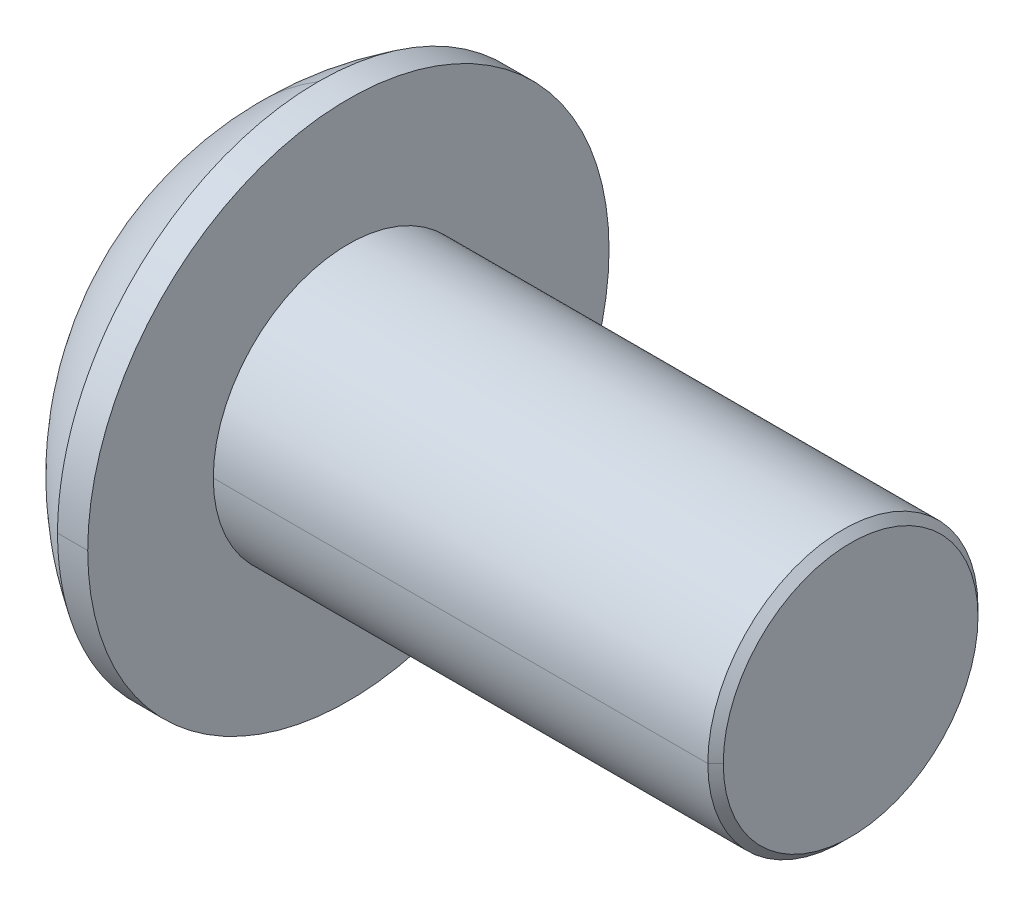
ISO-10303-21;
HEADER;
FILE_DESCRIPTION(('STEP AP214'),'2;1');
FILE_NAME('part.step','',(''),(''),'','','');
FILE_SCHEMA(('AUTOMOTIVE_DESIGN { 1 0 10303 214 1 1 1 1 }'));
ENDSEC;
DATA;
#1=APPLICATION_CONTEXT('core data for automotive mechanical design processes');
#2=APPLICATION_PROTOCOL_DEFINITION('international standard','automotive_design',2000,#1);
#3=PRODUCT_CONTEXT('',#1,'mechanical');
#4=PRODUCT('Part','Part','',(#3));
#5=PRODUCT_RELATED_PRODUCT_CATEGORY('part','',(#4));
#6=PRODUCT_DEFINITION_FORMATION('','',#4);
#7=PRODUCT_DEFINITION_CONTEXT('part definition',#1,'design');
#8=PRODUCT_DEFINITION('design','',#6,#7);
#9=PRODUCT_DEFINITION_SHAPE('','',#8);
#10=(LENGTH_UNIT() NAMED_UNIT(*) SI_UNIT(.MILLI.,.METRE.));
#11=(NAMED_UNIT(*) PLANE_ANGLE_UNIT() SI_UNIT($,.RADIAN.));
#12=(NAMED_UNIT(*) SI_UNIT($,.STERADIAN.) SOLID_ANGLE_UNIT());
#13=UNCERTAINTY_MEASURE_WITH_UNIT(LENGTH_MEASURE(1.E-05),#10,'distance_accuracy_value','');
#14=(GEOMETRIC_REPRESENTATION_CONTEXT(3) GLOBAL_UNCERTAINTY_ASSIGNED_CONTEXT((#13)) GLOBAL_UNIT_ASSIGNED_CONTEXT((#10,
#11,#12)) REPRESENTATION_CONTEXT('',''));
#15=CARTESIAN_POINT('',(0.,0.,0.));
#16=DIRECTION('',(0.,0.,1.));
#17=DIRECTION('',(1.,0.,0.));
#18=AXIS2_PLACEMENT_3D('',#15,#16,#17);
#19=CARTESIAN_POINT('',(-997.989959248641,0.,0.));
#20=DIRECTION('',(-1.,0.,0.));
#21=DIRECTION('',(0.,0.,1.));
#22=AXIS2_PLACEMENT_3D('',#19,#20,#21);
#23=CONICAL_SURFACE('',#22,1732.05080756886,1.0471975511966);
#24=DIRECTION('',(-0.5,0.,0.866025403784436));
#25=VECTOR('',#24,1.);
#26=CARTESIAN_POINT('',(2.01004075135859,0.,0.));
#27=LINE('',#26,#25);
#28=CARTESIAN_POINT('',(2.01004075135859,0.,0.));
#29=VERTEX_POINT('',#28);
#30=CARTESIAN_POINT('',(1.3208,0.,1.1938));
#31=VERTEX_POINT('',#30);
#32=EDGE_CURVE('E41',#29,#31,#27,.T.);
#33=ORIENTED_EDGE('',*,*,#32,.F.);
#34=DIRECTION('',(-0.5,0.,-0.866025403784436));
#35=VECTOR('',#34,1.);
#36=CARTESIAN_POINT('',(2.01004075135859,0.,0.));
#37=LINE('',#36,#35);
#38=CARTESIAN_POINT('',(1.3208,0.,-1.1938));
#39=VERTEX_POINT('',#38);
#40=EDGE_CURVE('E11',#29,#39,#37,.T.);
#41=ORIENTED_EDGE('',*,*,#40,.T.);
#42=CARTESIAN_POINT('',(1.3208,0.,0.));
#43=DIRECTION('',(-1.,0.,0.));
#44=DIRECTION('',(0.,0.,1.));
#45=AXIS2_PLACEMENT_3D('',#42,#43,#44);
#46=CIRCLE('',#45,1.1938);
#47=CARTESIAN_POINT('',(1.3208,-1.03386112703786,-0.5969));
#48=VERTEX_POINT('',#47);
#49=EDGE_CURVE('E27',#39,#48,#46,.T.);
#50=ORIENTED_EDGE('',*,*,#49,.T.);
#51=CARTESIAN_POINT('',(1.3208,0.,0.));
#52=DIRECTION('',(-1.,0.,0.));
#53=DIRECTION('',(0.,0.,1.));
#54=AXIS2_PLACEMENT_3D('',#51,#52,#53);
#55=CIRCLE('',#54,1.1938);
#56=CARTESIAN_POINT('',(1.3208,-1.03386112703786,0.5969));
#57=VERTEX_POINT('',#56);
#58=EDGE_CURVE('E248',#48,#57,#55,.T.);
#59=ORIENTED_EDGE('',*,*,#58,.T.);
#60=CARTESIAN_POINT('',(1.3208,0.,0.));
#61=DIRECTION('',(-1.,0.,0.));
#62=DIRECTION('',(0.,0.,1.));
#63=AXIS2_PLACEMENT_3D('',#60,#61,#62);
#64=CIRCLE('',#63,1.1938);
#65=EDGE_CURVE('E252',#57,#31,#64,.T.);
#66=ORIENTED_EDGE('',*,*,#65,.T.);
#67=EDGE_LOOP('',(#33,#41,#50,#59,#66));
#68=FACE_BOUND('',#67,.T.);
#69=ADVANCED_FACE('F16',(#68),#23,.F.);
#70=CARTESIAN_POINT('',(8.2042,0.,0.));
#71=DIRECTION('',(-1.,0.,0.));
#72=DIRECTION('',(0.,0.,1.));
#73=AXIS2_PLACEMENT_3D('',#70,#71,#72);
#74=CONICAL_SURFACE('',#73,1.61036,0.785398163397723);
#75=CARTESIAN_POINT('',(8.2042,0.,0.));
#76=DIRECTION('',(-1.,0.,0.));
#77=DIRECTION('',(0.,0.,1.));
#78=AXIS2_PLACEMENT_3D('',#75,#76,#77);
#79=CIRCLE('',#78,1.61036);
#80=CARTESIAN_POINT('',(8.2042,0.,1.61036));
#81=VERTEX_POINT('',#80);
#82=CARTESIAN_POINT('',(8.2042,0.,-1.61036));
#83=VERTEX_POINT('',#82);
#84=EDGE_CURVE('E255',#81,#83,#79,.T.);
#85=ORIENTED_EDGE('',*,*,#84,.T.);
#86=DIRECTION('',(-0.707106781186353,0.,-0.707106781186742));
#87=VECTOR('',#86,1.);
#88=CARTESIAN_POINT('',(8.2042,0.,-1.61036));
#89=LINE('',#88,#87);
#90=CARTESIAN_POINT('',(8.10641,0.,-1.70815));
#91=VERTEX_POINT('',#90);
#92=EDGE_CURVE('E334',#83,#91,#89,.T.);
#93=ORIENTED_EDGE('',*,*,#92,.T.);
#94=CARTESIAN_POINT('',(8.10641,0.,0.));
#95=DIRECTION('',(-1.,0.,0.));
#96=DIRECTION('',(0.,0.,1.));
#97=AXIS2_PLACEMENT_3D('',#94,#95,#96);
#98=CIRCLE('',#97,1.70815);
#99=CARTESIAN_POINT('',(8.10641,0.,1.70815));
#100=VERTEX_POINT('',#99);
#101=EDGE_CURVE('E328',#100,#91,#98,.T.);
#102=ORIENTED_EDGE('',*,*,#101,.F.);
#103=DIRECTION('',(-0.707106781186353,0.,0.707106781186742));
#104=VECTOR('',#103,1.);
#105=CARTESIAN_POINT('',(8.2042,0.,1.61036));
#106=LINE('',#105,#104);
#107=EDGE_CURVE('E227',#81,#100,#106,.T.);
#108=ORIENTED_EDGE('',*,*,#107,.F.);
#109=EDGE_LOOP('',(#85,#93,#102,#108));
#110=FACE_BOUND('',#109,.T.);
#111=ADVANCED_FACE('F612',(#110),#74,.T.);
#112=CARTESIAN_POINT('',(0.,0.,0.));
#113=DIRECTION('',(-1.,0.,0.));
#114=DIRECTION('',(0.,0.,1.));
#115=AXIS2_PLACEMENT_3D('',#112,#113,#114);
#116=CYLINDRICAL_SURFACE('',#115,1.70815);
#117=ORIENTED_EDGE('',*,*,#101,.T.);
#118=DIRECTION('',(-1.,0.,0.));
#119=VECTOR('',#118,1.);
#120=CARTESIAN_POINT('',(0.,0.,-1.70815));
#121=LINE('',#120,#119);
#122=CARTESIAN_POINT('',(1.8542,0.,-1.70815));
#123=VERTEX_POINT('',#122);
#124=EDGE_CURVE('E274',#91,#123,#121,.T.);
#125=ORIENTED_EDGE('',*,*,#124,.T.);
#126=CARTESIAN_POINT('',(1.8542,0.,0.));
#127=DIRECTION('',(-1.,0.,0.));
#128=DIRECTION('',(0.,0.,1.));
#129=AXIS2_PLACEMENT_3D('',#126,#127,#128);
#130=CIRCLE('',#129,1.70815);
#131=CARTESIAN_POINT('',(1.8542,0.,1.70815));
#132=VERTEX_POINT('',#131);
#133=EDGE_CURVE('E97',#132,#123,#130,.T.);
#134=ORIENTED_EDGE('',*,*,#133,.F.);
#135=DIRECTION('',(-1.,0.,0.));
#136=VECTOR('',#135,1.);
#137=CARTESIAN_POINT('',(0.,0.,1.70815));
#138=LINE('',#137,#136);
#139=EDGE_CURVE('E113',#100,#132,#138,.T.);
#140=ORIENTED_EDGE('',*,*,#139,.F.);
#141=EDGE_LOOP('',(#117,#125,#134,#140));
#142=FACE_BOUND('',#141,.T.);
#143=ADVANCED_FACE('F616',(#142),#116,.T.);
#144=CARTESIAN_POINT('',(0.,0.,0.));
#145=DIRECTION('',(-1.,0.,0.));
#146=DIRECTION('',(0.,0.,1.));
#147=AXIS2_PLACEMENT_3D('',#144,#145,#146);
#148=CYLINDRICAL_SURFACE('',#147,3.29565);
#149=CARTESIAN_POINT('',(1.8542,0.,0.));
#150=DIRECTION('',(-1.,0.,0.));
#151=DIRECTION('',(0.,0.,1.));
#152=AXIS2_PLACEMENT_3D('',#149,#150,#151);
#153=CIRCLE('',#152,3.29565);
#154=CARTESIAN_POINT('',(1.8542,0.,3.29565));
#155=VERTEX_POINT('',#154);
#156=CARTESIAN_POINT('',(1.8542,0.,-3.29565));
#157=VERTEX_POINT('',#156);
#158=EDGE_CURVE('E199',#155,#157,#153,.T.);
#159=ORIENTED_EDGE('',*,*,#158,.T.);
#160=DIRECTION('',(-1.,0.,0.));
#161=VECTOR('',#160,1.);
#162=CARTESIAN_POINT('',(0.,0.,-3.29565));
#163=LINE('',#162,#161);
#164=CARTESIAN_POINT('',(1.4732,0.,-3.29565));
#165=VERTEX_POINT('',#164);
#166=EDGE_CURVE('E194',#157,#165,#163,.T.);
#167=ORIENTED_EDGE('',*,*,#166,.T.);
#168=CARTESIAN_POINT('',(1.4732,0.,0.));
#169=DIRECTION('',(-1.,0.,0.));
#170=DIRECTION('',(0.,0.,1.));
#171=AXIS2_PLACEMENT_3D('',#168,#169,#170);
#172=CIRCLE('',#171,3.29565);
#173=CARTESIAN_POINT('',(1.4732,3.29565,0.));
#174=VERTEX_POINT('',#173);
#175=EDGE_CURVE('E182',#174,#165,#172,.T.);
#176=ORIENTED_EDGE('',*,*,#175,.F.);
#177=CARTESIAN_POINT('',(1.4732,0.,0.));
#178=DIRECTION('',(-1.,0.,0.));
#179=DIRECTION('',(0.,0.,1.));
#180=AXIS2_PLACEMENT_3D('',#177,#178,#179);
#181=CIRCLE('',#180,3.29565);
#182=CARTESIAN_POINT('',(1.4732,0.,3.29565));
#183=VERTEX_POINT('',#182);
#184=EDGE_CURVE('E373',#183,#174,#181,.T.);
#185=ORIENTED_EDGE('',*,*,#184,.F.);
#186=DIRECTION('',(-1.,0.,0.));
#187=VECTOR('',#186,1.);
#188=CARTESIAN_POINT('',(0.,0.,3.29565));
#189=LINE('',#188,#187);
#190=EDGE_CURVE('E259',#155,#183,#189,.T.);
#191=ORIENTED_EDGE('',*,*,#190,.F.);
#192=EDGE_LOOP('',(#159,#167,#176,#185,#191));
#193=FACE_BOUND('',#192,.T.);
#194=ADVANCED_FACE('F197',(#193),#148,.T.);
#195=CARTESIAN_POINT('',(3.50132362607759,0.,0.));
#196=DIRECTION('',(0.,0.,-1.));
#197=DIRECTION('',(0.,1.,0.));
#198=AXIS2_PLACEMENT_3D('',#195,#196,#197);
#199=SPHERICAL_SURFACE('',#198,3.86970210289554);
#200=ORIENTED_EDGE('',*,*,#175,.T.);
#201=CARTESIAN_POINT('',(1.4732,0.,0.));
#202=DIRECTION('',(-1.,0.,0.));
#203=DIRECTION('',(0.,0.,1.));
#204=AXIS2_PLACEMENT_3D('',#201,#202,#203);
#205=CIRCLE('',#204,3.29565);
#206=CARTESIAN_POINT('',(1.4732,-3.29565,0.));
#207=VERTEX_POINT('',#206);
#208=EDGE_CURVE('E187',#165,#207,#205,.T.);
#209=ORIENTED_EDGE('',*,*,#208,.T.);
#210=CARTESIAN_POINT('',(3.50132362607759,0.,0.));
#211=DIRECTION('',(0.,0.,-1.));
#212=DIRECTION('',(0.,1.,0.));
#213=AXIS2_PLACEMENT_3D('',#210,#211,#212);
#214=CIRCLE('',#213,3.86970210289554);
#215=CARTESIAN_POINT('',(0.,-1.647825,0.));
#216=VERTEX_POINT('',#215);
#217=EDGE_CURVE('E209',#207,#216,#214,.T.);
#218=ORIENTED_EDGE('',*,*,#217,.T.);
#219=CARTESIAN_POINT('',(0.,0.,0.));
#220=DIRECTION('',(-1.,0.,0.));
#221=DIRECTION('',(0.,0.,1.));
#222=AXIS2_PLACEMENT_3D('',#219,#220,#221);
#223=CIRCLE('',#222,1.647825);
#224=CARTESIAN_POINT('',(0.,1.647825,0.));
#225=VERTEX_POINT('',#224);
#226=EDGE_CURVE('E215',#225,#216,#223,.T.);
#227=ORIENTED_EDGE('',*,*,#226,.F.);
#228=CARTESIAN_POINT('',(3.50132362607759,0.,0.));
#229=DIRECTION('',(0.,0.,1.));
#230=DIRECTION('',(1.,0.,0.));
#231=AXIS2_PLACEMENT_3D('',#228,#229,#230);
#232=CIRCLE('',#231,3.86970210289554);
#233=EDGE_CURVE('E190',#174,#225,#232,.T.);
#234=ORIENTED_EDGE('',*,*,#233,.F.);
#235=EDGE_LOOP('',(#200,#209,#218,#227,#234));
#236=FACE_BOUND('',#235,.T.);
#237=ADVANCED_FACE('F184',(#236),#199,.T.);
#238=CARTESIAN_POINT('',(0.,0.,0.));
#239=DIRECTION('',(-1.,0.,0.));
#240=DIRECTION('',(0.,0.,1.));
#241=AXIS2_PLACEMENT_3D('',#238,#239,#240);
#242=PLANE('',#241);
#243=ORIENTED_EDGE('',*,*,#226,.T.);
#244=CARTESIAN_POINT('',(0.,0.,0.));
#245=DIRECTION('',(-1.,0.,0.));
#246=DIRECTION('',(0.,0.,1.));
#247=AXIS2_PLACEMENT_3D('',#244,#245,#246);
#248=CIRCLE('',#247,1.647825);
#249=EDGE_CURVE('E222',#216,#225,#248,.T.);
#250=ORIENTED_EDGE('',*,*,#249,.T.);
#251=EDGE_LOOP('',(#243,#250));
#252=FACE_BOUND('',#251,.T.);
#253=DIRECTION('',(0.,-1.,0.));
#254=VECTOR('',#253,1.);
#255=CARTESIAN_POINT('',(0.,-0.689240751358575,1.1938));
#256=LINE('',#255,#254);
#257=CARTESIAN_POINT('',(0.,0.689240751358575,1.1938));
#258=VERTEX_POINT('',#257);
#259=CARTESIAN_POINT('',(0.,-0.689240751358575,1.1938));
#260=VERTEX_POINT('',#259);
#261=EDGE_CURVE('E219',#258,#260,#256,.T.);
#262=ORIENTED_EDGE('',*,*,#261,.T.);
#263=DIRECTION('',(0.,-0.5,-0.866025403784439));
#264=VECTOR('',#263,1.);
#265=CARTESIAN_POINT('',(0.,-1.37848150271715,0.));
#266=LINE('',#265,#264);
#267=CARTESIAN_POINT('',(0.,-1.37848150271715,0.));
#268=VERTEX_POINT('',#267);
#269=EDGE_CURVE('E223',#260,#268,#266,.T.);
#270=ORIENTED_EDGE('',*,*,#269,.T.);
#271=DIRECTION('',(0.,0.5,-0.866025403784439));
#272=VECTOR('',#271,1.);
#273=CARTESIAN_POINT('',(0.,-0.689240751358575,-1.1938));
#274=LINE('',#273,#272);
#275=CARTESIAN_POINT('',(0.,-0.689240751358575,-1.1938));
#276=VERTEX_POINT('',#275);
#277=EDGE_CURVE('E233',#268,#276,#274,.T.);
#278=ORIENTED_EDGE('',*,*,#277,.T.);
#279=DIRECTION('',(0.,1.,0.));
#280=VECTOR('',#279,1.);
#281=CARTESIAN_POINT('',(0.,0.689240751358575,-1.1938));
#282=LINE('',#281,#280);
#283=CARTESIAN_POINT('',(0.,0.689240751358575,-1.1938));
#284=VERTEX_POINT('',#283);
#285=EDGE_CURVE('E229',#276,#284,#282,.T.);
#286=ORIENTED_EDGE('',*,*,#285,.T.);
#287=DIRECTION('',(0.,0.5,0.866025403784439));
#288=VECTOR('',#287,1.);
#289=CARTESIAN_POINT('',(0.,1.37848150271715,0.));
#290=LINE('',#289,#288);
#291=CARTESIAN_POINT('',(0.,1.37848150271715,0.));
#292=VERTEX_POINT('',#291);
#293=EDGE_CURVE('E234',#284,#292,#290,.T.);
#294=ORIENTED_EDGE('',*,*,#293,.T.);
#295=DIRECTION('',(0.,-0.5,0.866025403784439));
#296=VECTOR('',#295,1.);
#297=CARTESIAN_POINT('',(0.,0.689240751358575,1.1938));
#298=LINE('',#297,#296);
#299=EDGE_CURVE('E264',#292,#258,#298,.T.);
#300=ORIENTED_EDGE('',*,*,#299,.T.);
#301=EDGE_LOOP('',(#262,#270,#278,#286,#294,#300));
#302=FACE_BOUND('',#301,.T.);
#303=ADVANCED_FACE('F423',(#252,#302),#242,.T.);
#304=CARTESIAN_POINT('',(3.50132362607759,0.,0.));
#305=DIRECTION('',(0.,0.,-1.));
#306=DIRECTION('',(0.,1.,0.));
#307=AXIS2_PLACEMENT_3D('',#304,#305,#306);
#308=SPHERICAL_SURFACE('',#307,3.86970210289554);
#309=ORIENTED_EDGE('',*,*,#217,.F.);
#310=CARTESIAN_POINT('',(1.4732,0.,0.));
#311=DIRECTION('',(-1.,0.,0.));
#312=DIRECTION('',(0.,0.,1.));
#313=AXIS2_PLACEMENT_3D('',#310,#311,#312);
#314=CIRCLE('',#313,3.29565);
#315=EDGE_CURVE('E207',#207,#183,#314,.T.);
#316=ORIENTED_EDGE('',*,*,#315,.T.);
#317=ORIENTED_EDGE('',*,*,#184,.T.);
#318=ORIENTED_EDGE('',*,*,#233,.T.);
#319=ORIENTED_EDGE('',*,*,#249,.F.);
#320=EDGE_LOOP('',(#309,#316,#317,#318,#319));
#321=FACE_BOUND('',#320,.T.);
#322=ADVANCED_FACE('F521',(#321),#308,.T.);
#323=CARTESIAN_POINT('',(0.,0.,0.));
#324=DIRECTION('',(-1.,0.,0.));
#325=DIRECTION('',(0.,0.,1.));
#326=AXIS2_PLACEMENT_3D('',#323,#324,#325);
#327=CYLINDRICAL_SURFACE('',#326,3.29565);
#328=ORIENTED_EDGE('',*,*,#166,.F.);
#329=CARTESIAN_POINT('',(1.8542,0.,0.));
#330=DIRECTION('',(-1.,0.,0.));
#331=DIRECTION('',(0.,0.,1.));
#332=AXIS2_PLACEMENT_3D('',#329,#330,#331);
#333=CIRCLE('',#332,3.29565);
#334=EDGE_CURVE('E256',#157,#155,#333,.T.);
#335=ORIENTED_EDGE('',*,*,#334,.T.);
#336=ORIENTED_EDGE('',*,*,#190,.T.);
#337=ORIENTED_EDGE('',*,*,#315,.F.);
#338=ORIENTED_EDGE('',*,*,#208,.F.);
#339=EDGE_LOOP('',(#328,#335,#336,#337,#338));
#340=FACE_BOUND('',#339,.T.);
#341=ADVANCED_FACE('F205',(#340),#327,.T.);
#342=CARTESIAN_POINT('',(1.8542,1.70815,0.));
#343=DIRECTION('',(-1.,0.,0.));
#344=DIRECTION('',(0.,0.,1.));
#345=AXIS2_PLACEMENT_3D('',#342,#343,#344);
#346=PLANE('',#345);
#347=ORIENTED_EDGE('',*,*,#158,.F.);
#348=ORIENTED_EDGE('',*,*,#334,.F.);
#349=EDGE_LOOP('',(#347,#348));
#350=FACE_BOUND('',#349,.T.);
#351=ORIENTED_EDGE('',*,*,#133,.T.);
#352=CARTESIAN_POINT('',(1.8542,0.,0.));
#353=DIRECTION('',(-1.,0.,0.));
#354=DIRECTION('',(0.,0.,1.));
#355=AXIS2_PLACEMENT_3D('',#352,#353,#354);
#356=CIRCLE('',#355,1.70815);
#357=EDGE_CURVE('E345',#123,#132,#356,.T.);
#358=ORIENTED_EDGE('',*,*,#357,.T.);
#359=EDGE_LOOP('',(#351,#358));
#360=FACE_BOUND('',#359,.T.);
#361=ADVANCED_FACE('F551',(#350,#360),#346,.F.);
#362=CARTESIAN_POINT('',(0.,0.,0.));
#363=DIRECTION('',(-1.,0.,0.));
#364=DIRECTION('',(0.,0.,1.));
#365=AXIS2_PLACEMENT_3D('',#362,#363,#364);
#366=CYLINDRICAL_SURFACE('',#365,1.70815);
#367=ORIENTED_EDGE('',*,*,#124,.F.);
#368=CARTESIAN_POINT('',(8.10641,0.,0.));
#369=DIRECTION('',(-1.,0.,0.));
#370=DIRECTION('',(0.,0.,1.));
#371=AXIS2_PLACEMENT_3D('',#368,#369,#370);
#372=CIRCLE('',#371,1.70815);
#373=EDGE_CURVE('E348',#91,#100,#372,.T.);
#374=ORIENTED_EDGE('',*,*,#373,.T.);
#375=ORIENTED_EDGE('',*,*,#139,.T.);
#376=ORIENTED_EDGE('',*,*,#357,.F.);
#377=EDGE_LOOP('',(#367,#374,#375,#376));
#378=FACE_BOUND('',#377,.T.);
#379=ADVANCED_FACE('F542',(#378),#366,.T.);
#380=CARTESIAN_POINT('',(8.2042,0.,0.));
#381=DIRECTION('',(-1.,0.,0.));
#382=DIRECTION('',(0.,0.,1.));
#383=AXIS2_PLACEMENT_3D('',#380,#381,#382);
#384=CONICAL_SURFACE('',#383,1.61036,0.785398163397723);
#385=ORIENTED_EDGE('',*,*,#92,.F.);
#386=CARTESIAN_POINT('',(8.2042,0.,0.));
#387=DIRECTION('',(-1.,0.,0.));
#388=DIRECTION('',(0.,0.,1.));
#389=AXIS2_PLACEMENT_3D('',#386,#387,#388);
#390=CIRCLE('',#389,1.61036);
#391=EDGE_CURVE('E238',#83,#81,#390,.T.);
#392=ORIENTED_EDGE('',*,*,#391,.T.);
#393=ORIENTED_EDGE('',*,*,#107,.T.);
#394=ORIENTED_EDGE('',*,*,#373,.F.);
#395=EDGE_LOOP('',(#385,#392,#393,#394));
#396=FACE_BOUND('',#395,.T.);
#397=ADVANCED_FACE('F537',(#396),#384,.T.);
#398=CARTESIAN_POINT('',(8.2042,0.,0.));
#399=DIRECTION('',(-1.,0.,0.));
#400=DIRECTION('',(0.,0.,1.));
#401=AXIS2_PLACEMENT_3D('',#398,#399,#400);
#402=PLANE('',#401);
#403=ORIENTED_EDGE('',*,*,#84,.F.);
#404=ORIENTED_EDGE('',*,*,#391,.F.);
#405=EDGE_LOOP('',(#403,#404));
#406=FACE_BOUND('',#405,.T.);
#407=ADVANCED_FACE('F541',(#406),#402,.F.);
#408=CARTESIAN_POINT('',(1.3208,-1.37848150271715,0.));
#409=DIRECTION('',(0.,0.866025403784439,-0.5));
#410=DIRECTION('',(-1.,0.,0.));
#411=AXIS2_PLACEMENT_3D('',#408,#409,#410);
#412=PLANE('',#411);
#413=DIRECTION('',(0.,-0.5,-0.866025403784439));
#414=VECTOR('',#413,1.);
#415=CARTESIAN_POINT('',(1.3208,-1.37848150271715,0.));
#416=LINE('',#415,#414);
#417=CARTESIAN_POINT('',(1.3208,-0.689240751358575,1.1938));
#418=VERTEX_POINT('',#417);
#419=EDGE_CURVE('E224',#418,#57,#416,.T.);
#420=ORIENTED_EDGE('',*,*,#419,.T.);
#421=DIRECTION('',(0.,-0.5,-0.866025403784439));
#422=VECTOR('',#421,1.);
#423=CARTESIAN_POINT('',(1.3208,-1.37848150271715,0.));
#424=LINE('',#423,#422);
#425=CARTESIAN_POINT('',(1.3208,-1.37848150271715,0.));
#426=VERTEX_POINT('',#425);
#427=EDGE_CURVE('E228',#57,#426,#424,.T.);
#428=ORIENTED_EDGE('',*,*,#427,.T.);
#429=DIRECTION('',(-1.,0.,0.));
#430=VECTOR('',#429,1.);
#431=CARTESIAN_POINT('',(1.3208,-1.37848150271715,0.));
#432=LINE('',#431,#430);
#433=EDGE_CURVE('E284',#426,#268,#432,.T.);
#434=ORIENTED_EDGE('',*,*,#433,.T.);
#435=ORIENTED_EDGE('',*,*,#269,.F.);
#436=DIRECTION('',(-1.,0.,0.));
#437=VECTOR('',#436,1.);
#438=CARTESIAN_POINT('',(1.3208,-0.689240751358575,1.1938));
#439=LINE('',#438,#437);
#440=EDGE_CURVE('E20',#418,#260,#439,.T.);
#441=ORIENTED_EDGE('',*,*,#440,.F.);
#442=EDGE_LOOP('',(#420,#428,#434,#435,#441));
#443=FACE_BOUND('',#442,.T.);
#444=ADVANCED_FACE('F407',(#443),#412,.T.);
#445=CARTESIAN_POINT('',(1.3208,-0.689240751358575,-1.1938));
#446=DIRECTION('',(0.,0.866025403784439,0.5));
#447=DIRECTION('',(1.,0.,0.));
#448=AXIS2_PLACEMENT_3D('',#445,#446,#447);
#449=PLANE('',#448);
#450=DIRECTION('',(0.,0.5,-0.866025403784439));
#451=VECTOR('',#450,1.);
#452=CARTESIAN_POINT('',(1.3208,-0.689240751358575,-1.1938));
#453=LINE('',#452,#451);
#454=EDGE_CURVE('E281',#426,#48,#453,.T.);
#455=ORIENTED_EDGE('',*,*,#454,.T.);
#456=DIRECTION('',(0.,0.5,-0.866025403784439));
#457=VECTOR('',#456,1.);
#458=CARTESIAN_POINT('',(1.3208,-0.689240751358575,-1.1938));
#459=LINE('',#458,#457);
#460=CARTESIAN_POINT('',(1.3208,-0.689240751358575,-1.1938));
#461=VERTEX_POINT('',#460);
#462=EDGE_CURVE('E285',#48,#461,#459,.T.);
#463=ORIENTED_EDGE('',*,*,#462,.T.);
#464=DIRECTION('',(-1.,0.,0.));
#465=VECTOR('',#464,1.);
#466=CARTESIAN_POINT('',(1.3208,-0.689240751358575,-1.1938));
#467=LINE('',#466,#465);
#468=EDGE_CURVE('E297',#461,#276,#467,.T.);
#469=ORIENTED_EDGE('',*,*,#468,.T.);
#470=ORIENTED_EDGE('',*,*,#277,.F.);
#471=ORIENTED_EDGE('',*,*,#433,.F.);
#472=EDGE_LOOP('',(#455,#463,#469,#470,#471));
#473=FACE_BOUND('',#472,.T.);
#474=ADVANCED_FACE('F421',(#473),#449,.T.);
#475=CARTESIAN_POINT('',(1.3208,0.689240751358575,-1.1938));
#476=DIRECTION('',(0.,0.,1.));
#477=DIRECTION('',(1.,0.,0.));
#478=AXIS2_PLACEMENT_3D('',#475,#476,#477);
#479=PLANE('',#478);
#480=DIRECTION('',(0.,1.,0.));
#481=VECTOR('',#480,1.);
#482=CARTESIAN_POINT('',(1.3208,0.689240751358575,-1.1938));
#483=LINE('',#482,#481);
#484=EDGE_CURVE('E290',#461,#39,#483,.T.);
#485=ORIENTED_EDGE('',*,*,#484,.T.);
#486=DIRECTION('',(0.,1.,0.));
#487=VECTOR('',#486,1.);
#488=CARTESIAN_POINT('',(1.3208,0.689240751358575,-1.1938));
#489=LINE('',#488,#487);
#490=CARTESIAN_POINT('',(1.3208,0.689240751358575,-1.1938));
#491=VERTEX_POINT('',#490);
#492=EDGE_CURVE('E286',#39,#491,#489,.T.);
#493=ORIENTED_EDGE('',*,*,#492,.T.);
#494=DIRECTION('',(-1.,0.,0.));
#495=VECTOR('',#494,1.);
#496=CARTESIAN_POINT('',(1.3208,0.689240751358575,-1.1938));
#497=LINE('',#496,#495);
#498=EDGE_CURVE('E246',#491,#284,#497,.T.);
#499=ORIENTED_EDGE('',*,*,#498,.T.);
#500=ORIENTED_EDGE('',*,*,#285,.F.);
#501=ORIENTED_EDGE('',*,*,#468,.F.);
#502=EDGE_LOOP('',(#485,#493,#499,#500,#501));
#503=FACE_BOUND('',#502,.T.);
#504=ADVANCED_FACE('F527',(#503),#479,.T.);
#505=CARTESIAN_POINT('',(1.3208,1.37848150271715,0.));
#506=DIRECTION('',(0.,-0.866025403784439,0.5));
#507=DIRECTION('',(-1.,0.,0.));
#508=AXIS2_PLACEMENT_3D('',#505,#506,#507);
#509=PLANE('',#508);
#510=DIRECTION('',(0.,0.5,0.866025403784439));
#511=VECTOR('',#510,1.);
#512=CARTESIAN_POINT('',(1.3208,1.37848150271715,0.));
#513=LINE('',#512,#511);
#514=CARTESIAN_POINT('',(1.3208,1.03386112703786,-0.5969));
#515=VERTEX_POINT('',#514);
#516=EDGE_CURVE('E242',#491,#515,#513,.T.);
#517=ORIENTED_EDGE('',*,*,#516,.T.);
#518=DIRECTION('',(0.,0.5,0.866025403784439));
#519=VECTOR('',#518,1.);
#520=CARTESIAN_POINT('',(1.3208,1.37848150271715,0.));
#521=LINE('',#520,#519);
#522=CARTESIAN_POINT('',(1.3208,1.37848150271715,0.));
#523=VERTEX_POINT('',#522);
#524=EDGE_CURVE('E247',#515,#523,#521,.T.);
#525=ORIENTED_EDGE('',*,*,#524,.T.);
#526=DIRECTION('',(-1.,0.,0.));
#527=VECTOR('',#526,1.);
#528=CARTESIAN_POINT('',(1.3208,1.37848150271715,0.));
#529=LINE('',#528,#527);
#530=EDGE_CURVE('E304',#523,#292,#529,.T.);
#531=ORIENTED_EDGE('',*,*,#530,.T.);
#532=ORIENTED_EDGE('',*,*,#293,.F.);
#533=ORIENTED_EDGE('',*,*,#498,.F.);
#534=EDGE_LOOP('',(#517,#525,#531,#532,#533));
#535=FACE_BOUND('',#534,.T.);
#536=ADVANCED_FACE('F531',(#535),#509,.T.);
#537=CARTESIAN_POINT('',(1.3208,0.689240751358575,1.1938));
#538=DIRECTION('',(0.,-0.866025403784439,-0.5));
#539=DIRECTION('',(0.,0.5,-0.866025403784439));
#540=AXIS2_PLACEMENT_3D('',#537,#538,#539);
#541=PLANE('',#540);
#542=DIRECTION('',(0.,-0.5,0.866025403784439));
#543=VECTOR('',#542,1.);
#544=CARTESIAN_POINT('',(1.3208,0.689240751358575,1.1938));
#545=LINE('',#544,#543);
#546=CARTESIAN_POINT('',(1.3208,1.03386112703786,0.5969));
#547=VERTEX_POINT('',#546);
#548=EDGE_CURVE('E301',#523,#547,#545,.T.);
#549=ORIENTED_EDGE('',*,*,#548,.T.);
#550=DIRECTION('',(0.,-0.5,0.866025403784439));
#551=VECTOR('',#550,1.);
#552=CARTESIAN_POINT('',(1.3208,0.689240751358575,1.1938));
#553=LINE('',#552,#551);
#554=CARTESIAN_POINT('',(1.3208,0.689240751358575,1.1938));
#555=VERTEX_POINT('',#554);
#556=EDGE_CURVE('E278',#547,#555,#553,.T.);
#557=ORIENTED_EDGE('',*,*,#556,.T.);
#558=DIRECTION('',(-1.,0.,0.));
#559=VECTOR('',#558,1.);
#560=CARTESIAN_POINT('',(1.3208,0.689240751358575,1.1938));
#561=LINE('',#560,#559);
#562=EDGE_CURVE('E275',#555,#258,#561,.T.);
#563=ORIENTED_EDGE('',*,*,#562,.T.);
#564=ORIENTED_EDGE('',*,*,#299,.F.);
#565=ORIENTED_EDGE('',*,*,#530,.F.);
#566=EDGE_LOOP('',(#549,#557,#563,#564,#565));
#567=FACE_BOUND('',#566,.T.);
#568=ADVANCED_FACE('F575',(#567),#541,.T.);
#569=CARTESIAN_POINT('',(1.3208,-0.689240751358575,1.1938));
#570=DIRECTION('',(0.,0.,-1.));
#571=DIRECTION('',(-1.,0.,0.));
#572=AXIS2_PLACEMENT_3D('',#569,#570,#571);
#573=PLANE('',#572);
#574=DIRECTION('',(0.,-1.,0.));
#575=VECTOR('',#574,1.);
#576=CARTESIAN_POINT('',(1.3208,-0.689240751358575,1.1938));
#577=LINE('',#576,#575);
#578=EDGE_CURVE('E279',#555,#31,#577,.T.);
#579=ORIENTED_EDGE('',*,*,#578,.T.);
#580=DIRECTION('',(0.,-1.,0.));
#581=VECTOR('',#580,1.);
#582=CARTESIAN_POINT('',(1.3208,-0.689240751358575,1.1938));
#583=LINE('',#582,#581);
#584=EDGE_CURVE('E358',#31,#418,#583,.T.);
#585=ORIENTED_EDGE('',*,*,#584,.T.);
#586=ORIENTED_EDGE('',*,*,#440,.T.);
#587=ORIENTED_EDGE('',*,*,#261,.F.);
#588=ORIENTED_EDGE('',*,*,#562,.F.);
#589=EDGE_LOOP('',(#579,#585,#586,#587,#588));
#590=FACE_BOUND('',#589,.T.);
#591=ADVANCED_FACE('F404',(#590),#573,.T.);
#592=CARTESIAN_POINT('',(1.3208,-2.06772225407573,-1.1938));
#593=DIRECTION('',(1.,0.,0.));
#594=DIRECTION('',(0.,1.,0.));
#595=AXIS2_PLACEMENT_3D('',#592,#593,#594);
#596=PLANE('',#595);
#597=CARTESIAN_POINT('',(1.3208,0.,0.));
#598=DIRECTION('',(-1.,0.,0.));
#599=DIRECTION('',(0.,0.,1.));
#600=AXIS2_PLACEMENT_3D('',#597,#598,#599);
#601=CIRCLE('',#600,1.1938);
#602=EDGE_CURVE('E324',#515,#39,#601,.T.);
#603=ORIENTED_EDGE('',*,*,#602,.F.);
#604=ORIENTED_EDGE('',*,*,#516,.F.);
#605=ORIENTED_EDGE('',*,*,#492,.F.);
#606=EDGE_LOOP('',(#603,#604,#605));
#607=FACE_BOUND('',#606,.T.);
#608=ADVANCED_FACE('F574',(#607),#596,.F.);
#609=CARTESIAN_POINT('',(1.3208,-2.06772225407573,-1.1938));
#610=DIRECTION('',(1.,0.,0.));
#611=DIRECTION('',(0.,1.,0.));
#612=AXIS2_PLACEMENT_3D('',#609,#610,#611);
#613=PLANE('',#612);
#614=CARTESIAN_POINT('',(1.3208,0.,0.));
#615=DIRECTION('',(-1.,0.,0.));
#616=DIRECTION('',(0.,0.,1.));
#617=AXIS2_PLACEMENT_3D('',#614,#615,#616);
#618=CIRCLE('',#617,1.1938);
#619=EDGE_CURVE('E263',#547,#515,#618,.T.);
#620=ORIENTED_EDGE('',*,*,#619,.F.);
#621=ORIENTED_EDGE('',*,*,#548,.F.);
#622=ORIENTED_EDGE('',*,*,#524,.F.);
#623=EDGE_LOOP('',(#620,#621,#622));
#624=FACE_BOUND('',#623,.T.);
#625=ADVANCED_FACE('F18',(#624),#613,.F.);
#626=CARTESIAN_POINT('',(1.3208,-2.06772225407573,-1.1938));
#627=DIRECTION('',(1.,0.,0.));
#628=DIRECTION('',(0.,1.,0.));
#629=AXIS2_PLACEMENT_3D('',#626,#627,#628);
#630=PLANE('',#629);
#631=CARTESIAN_POINT('',(1.3208,0.,0.));
#632=DIRECTION('',(-1.,0.,0.));
#633=DIRECTION('',(0.,0.,1.));
#634=AXIS2_PLACEMENT_3D('',#631,#632,#633);
#635=CIRCLE('',#634,1.1938);
#636=EDGE_CURVE('E237',#31,#547,#635,.T.);
#637=ORIENTED_EDGE('',*,*,#636,.F.);
#638=ORIENTED_EDGE('',*,*,#578,.F.);
#639=ORIENTED_EDGE('',*,*,#556,.F.);
#640=EDGE_LOOP('',(#637,#638,#639));
#641=FACE_BOUND('',#640,.T.);
#642=ADVANCED_FACE('F651',(#641),#630,.F.);
#643=CARTESIAN_POINT('',(1.3208,-2.06772225407573,-1.1938));
#644=DIRECTION('',(1.,0.,0.));
#645=DIRECTION('',(0.,1.,0.));
#646=AXIS2_PLACEMENT_3D('',#643,#644,#645);
#647=PLANE('',#646);
#648=ORIENTED_EDGE('',*,*,#65,.F.);
#649=ORIENTED_EDGE('',*,*,#419,.F.);
#650=ORIENTED_EDGE('',*,*,#584,.F.);
#651=EDGE_LOOP('',(#648,#649,#650));
#652=FACE_BOUND('',#651,.T.);
#653=ADVANCED_FACE('F411',(#652),#647,.F.);
#654=CARTESIAN_POINT('',(1.3208,-2.06772225407573,-1.1938));
#655=DIRECTION('',(1.,0.,0.));
#656=DIRECTION('',(0.,1.,0.));
#657=AXIS2_PLACEMENT_3D('',#654,#655,#656);
#658=PLANE('',#657);
#659=ORIENTED_EDGE('',*,*,#58,.F.);
#660=ORIENTED_EDGE('',*,*,#454,.F.);
#661=ORIENTED_EDGE('',*,*,#427,.F.);
#662=EDGE_LOOP('',(#659,#660,#661));
#663=FACE_BOUND('',#662,.T.);
#664=ADVANCED_FACE('F419',(#663),#658,.F.);
#665=CARTESIAN_POINT('',(1.3208,-2.06772225407573,-1.1938));
#666=DIRECTION('',(1.,0.,0.));
#667=DIRECTION('',(0.,1.,0.));
#668=AXIS2_PLACEMENT_3D('',#665,#666,#667);
#669=PLANE('',#668);
#670=ORIENTED_EDGE('',*,*,#49,.F.);
#671=ORIENTED_EDGE('',*,*,#484,.F.);
#672=ORIENTED_EDGE('',*,*,#462,.F.);
#673=EDGE_LOOP('',(#670,#671,#672));
#674=FACE_BOUND('',#673,.T.);
#675=ADVANCED_FACE('F580',(#674),#669,.F.);
#676=CARTESIAN_POINT('',(-997.989959248641,0.,0.));
#677=DIRECTION('',(-1.,0.,0.));
#678=DIRECTION('',(0.,0.,1.));
#679=AXIS2_PLACEMENT_3D('',#676,#677,#678);
#680=CONICAL_SURFACE('',#679,1732.05080756886,1.0471975511966);
#681=ORIENTED_EDGE('',*,*,#40,.F.);
#682=ORIENTED_EDGE('',*,*,#32,.T.);
#683=ORIENTED_EDGE('',*,*,#636,.T.);
#684=ORIENTED_EDGE('',*,*,#619,.T.);
#685=ORIENTED_EDGE('',*,*,#602,.T.);
#686=EDGE_LOOP('',(#681,#682,#683,#684,#685));
#687=FACE_BOUND('',#686,.T.);
#688=ADVANCED_FACE('F584',(#687),#680,.F.);
#689=CLOSED_SHELL('',(#69,#111,#143,#194,#237,#303,#322,#341,#361,#379,#397,#407,#444,#474,#504,
#536,#568,#591,#608,#625,#642,#653,#664,#675,#688));
#690=MANIFOLD_SOLID_BREP('B1',#689);
#691=ADVANCED_BREP_SHAPE_REPRESENTATION('',(#18,#690),#14);
#692=SHAPE_DEFINITION_REPRESENTATION(#9,#691);
ENDSEC;
END-ISO-10303-21;
